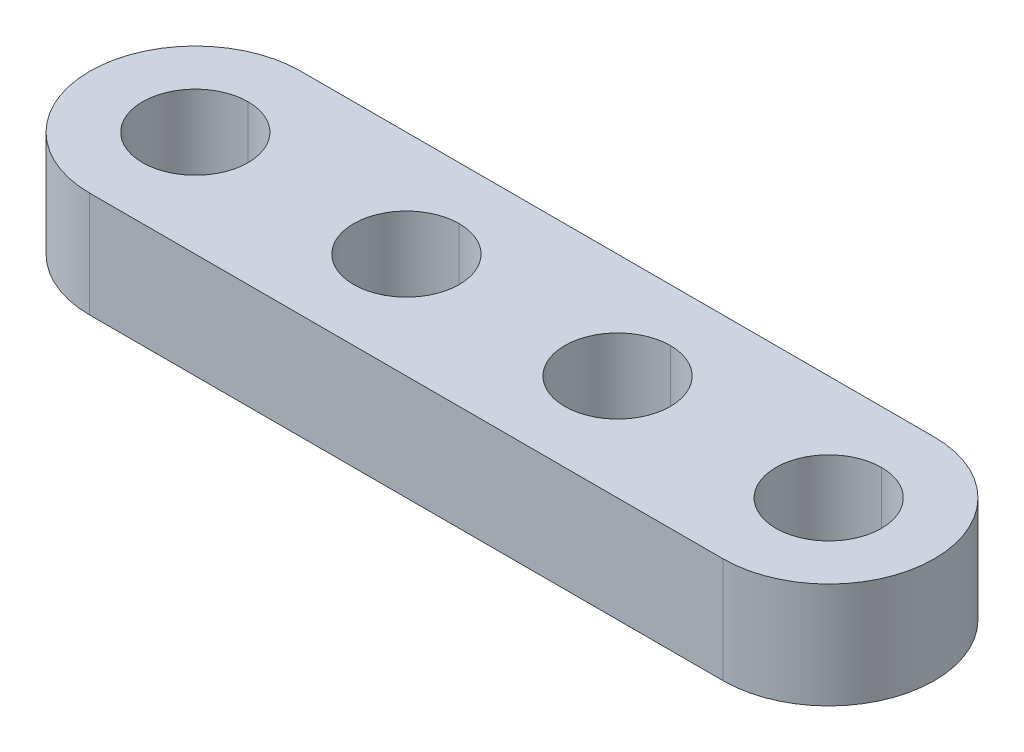
ISO-10303-21;
HEADER;
FILE_DESCRIPTION(('STEP AP214'),'2;1');
FILE_NAME('part.step','',(''),(''),'','','');
FILE_SCHEMA(('AUTOMOTIVE_DESIGN { 1 0 10303 214 1 1 1 1 }'));
ENDSEC;
DATA;
#1=APPLICATION_CONTEXT('core data for automotive mechanical design processes');
#2=APPLICATION_PROTOCOL_DEFINITION('international standard','automotive_design',2000,#1);
#3=PRODUCT_CONTEXT('',#1,'mechanical');
#4=PRODUCT('Part','Part','',(#3));
#5=PRODUCT_RELATED_PRODUCT_CATEGORY('part','',(#4));
#6=PRODUCT_DEFINITION_FORMATION('','',#4);
#7=PRODUCT_DEFINITION_CONTEXT('part definition',#1,'design');
#8=PRODUCT_DEFINITION('design','',#6,#7);
#9=PRODUCT_DEFINITION_SHAPE('','',#8);
#10=(LENGTH_UNIT() NAMED_UNIT(*) SI_UNIT(.MILLI.,.METRE.));
#11=(NAMED_UNIT(*) PLANE_ANGLE_UNIT() SI_UNIT($,.RADIAN.));
#12=(NAMED_UNIT(*) SI_UNIT($,.STERADIAN.) SOLID_ANGLE_UNIT());
#13=UNCERTAINTY_MEASURE_WITH_UNIT(LENGTH_MEASURE(1.E-05),#10,'distance_accuracy_value','');
#14=(GEOMETRIC_REPRESENTATION_CONTEXT(3) GLOBAL_UNCERTAINTY_ASSIGNED_CONTEXT((#13)) GLOBAL_UNIT_ASSIGNED_CONTEXT((#10,
#11,#12)) REPRESENTATION_CONTEXT('',''));
#15=CARTESIAN_POINT('',(0.,0.,0.));
#16=DIRECTION('',(0.,0.,1.));
#17=DIRECTION('',(1.,0.,0.));
#18=AXIS2_PLACEMENT_3D('',#15,#16,#17);
#19=CARTESIAN_POINT('',(12.,4.,0.));
#20=DIRECTION('',(0.,1.,0.));
#21=DIRECTION('',(0.,0.,1.));
#22=AXIS2_PLACEMENT_3D('',#19,#20,#21);
#23=CYLINDRICAL_SURFACE('',#22,2.);
#24=DIRECTION('',(0.,1.,0.));
#25=VECTOR('',#24,1.);
#26=CARTESIAN_POINT('',(12.,4.,-2.));
#27=LINE('',#26,#25);
#28=CARTESIAN_POINT('',(12.,0.,-2.));
#29=VERTEX_POINT('',#28);
#30=CARTESIAN_POINT('',(12.,4.,-2.));
#31=VERTEX_POINT('',#30);
#32=EDGE_CURVE('E137',#29,#31,#27,.T.);
#33=ORIENTED_EDGE('',*,*,#32,.F.);
#34=CARTESIAN_POINT('',(12.,0.,0.));
#35=DIRECTION('',(0.,1.,0.));
#36=DIRECTION('',(0.,0.,1.));
#37=AXIS2_PLACEMENT_3D('',#34,#35,#36);
#38=CIRCLE('',#37,2.);
#39=CARTESIAN_POINT('',(12.,0.,2.));
#40=VERTEX_POINT('',#39);
#41=EDGE_CURVE('E132',#40,#29,#38,.T.);
#42=ORIENTED_EDGE('',*,*,#41,.F.);
#43=DIRECTION('',(0.,1.,0.));
#44=VECTOR('',#43,1.);
#45=CARTESIAN_POINT('',(12.,4.,2.));
#46=LINE('',#45,#44);
#47=CARTESIAN_POINT('',(12.,4.,2.));
#48=VERTEX_POINT('',#47);
#49=EDGE_CURVE('E134',#40,#48,#46,.T.);
#50=ORIENTED_EDGE('',*,*,#49,.T.);
#51=CARTESIAN_POINT('',(12.,4.,0.));
#52=DIRECTION('',(0.,1.,0.));
#53=DIRECTION('',(0.,0.,1.));
#54=AXIS2_PLACEMENT_3D('',#51,#52,#53);
#55=CIRCLE('',#54,2.);
#56=EDGE_CURVE('E172',#48,#31,#55,.T.);
#57=ORIENTED_EDGE('',*,*,#56,.T.);
#58=EDGE_LOOP('',(#33,#42,#50,#57));
#59=FACE_BOUND('',#58,.T.);
#60=ADVANCED_FACE('F15',(#59),#23,.F.);
#61=CARTESIAN_POINT('',(4.,4.,0.));
#62=DIRECTION('',(0.,1.,0.));
#63=DIRECTION('',(0.,0.,1.));
#64=AXIS2_PLACEMENT_3D('',#61,#62,#63);
#65=CYLINDRICAL_SURFACE('',#64,2.);
#66=DIRECTION('',(0.,1.,0.));
#67=VECTOR('',#66,1.);
#68=CARTESIAN_POINT('',(4.,4.,-2.));
#69=LINE('',#68,#67);
#70=CARTESIAN_POINT('',(4.,0.,-2.));
#71=VERTEX_POINT('',#70);
#72=CARTESIAN_POINT('',(4.,4.,-2.));
#73=VERTEX_POINT('',#72);
#74=EDGE_CURVE('E550',#71,#73,#69,.T.);
#75=ORIENTED_EDGE('',*,*,#74,.F.);
#76=CARTESIAN_POINT('',(4.,0.,0.));
#77=DIRECTION('',(0.,1.,0.));
#78=DIRECTION('',(0.,0.,1.));
#79=AXIS2_PLACEMENT_3D('',#76,#77,#78);
#80=CIRCLE('',#79,2.);
#81=CARTESIAN_POINT('',(4.,0.,2.));
#82=VERTEX_POINT('',#81);
#83=EDGE_CURVE('E72',#82,#71,#80,.T.);
#84=ORIENTED_EDGE('',*,*,#83,.F.);
#85=DIRECTION('',(0.,1.,0.));
#86=VECTOR('',#85,1.);
#87=CARTESIAN_POINT('',(4.,4.,2.));
#88=LINE('',#87,#86);
#89=CARTESIAN_POINT('',(4.,4.,2.));
#90=VERTEX_POINT('',#89);
#91=EDGE_CURVE('E189',#82,#90,#88,.T.);
#92=ORIENTED_EDGE('',*,*,#91,.T.);
#93=CARTESIAN_POINT('',(4.,4.,0.));
#94=DIRECTION('',(0.,1.,0.));
#95=DIRECTION('',(0.,0.,1.));
#96=AXIS2_PLACEMENT_3D('',#93,#94,#95);
#97=CIRCLE('',#96,2.);
#98=EDGE_CURVE('E59',#90,#73,#97,.T.);
#99=ORIENTED_EDGE('',*,*,#98,.T.);
#100=EDGE_LOOP('',(#75,#84,#92,#99));
#101=FACE_BOUND('',#100,.T.);
#102=ADVANCED_FACE('F309',(#101),#65,.F.);
#103=CARTESIAN_POINT('',(-4.,4.,0.));
#104=DIRECTION('',(0.,1.,0.));
#105=DIRECTION('',(0.,0.,1.));
#106=AXIS2_PLACEMENT_3D('',#103,#104,#105);
#107=CYLINDRICAL_SURFACE('',#106,2.);
#108=DIRECTION('',(0.,1.,0.));
#109=VECTOR('',#108,1.);
#110=CARTESIAN_POINT('',(-4.,4.,-2.));
#111=LINE('',#110,#109);
#112=CARTESIAN_POINT('',(-4.,0.,-2.));
#113=VERTEX_POINT('',#112);
#114=CARTESIAN_POINT('',(-4.,4.,-2.));
#115=VERTEX_POINT('',#114);
#116=EDGE_CURVE('E197',#113,#115,#111,.T.);
#117=ORIENTED_EDGE('',*,*,#116,.F.);
#118=CARTESIAN_POINT('',(-4.,0.,0.));
#119=DIRECTION('',(0.,1.,0.));
#120=DIRECTION('',(0.,0.,1.));
#121=AXIS2_PLACEMENT_3D('',#118,#119,#120);
#122=CIRCLE('',#121,2.);
#123=CARTESIAN_POINT('',(-4.,0.,2.));
#124=VERTEX_POINT('',#123);
#125=EDGE_CURVE('E25',#124,#113,#122,.T.);
#126=ORIENTED_EDGE('',*,*,#125,.F.);
#127=DIRECTION('',(0.,1.,0.));
#128=VECTOR('',#127,1.);
#129=CARTESIAN_POINT('',(-4.,4.,2.));
#130=LINE('',#129,#128);
#131=CARTESIAN_POINT('',(-4.,4.,2.));
#132=VERTEX_POINT('',#131);
#133=EDGE_CURVE('E233',#124,#132,#130,.T.);
#134=ORIENTED_EDGE('',*,*,#133,.T.);
#135=CARTESIAN_POINT('',(-4.,4.,0.));
#136=DIRECTION('',(0.,1.,0.));
#137=DIRECTION('',(0.,0.,1.));
#138=AXIS2_PLACEMENT_3D('',#135,#136,#137);
#139=CIRCLE('',#138,2.);
#140=EDGE_CURVE('E95',#132,#115,#139,.T.);
#141=ORIENTED_EDGE('',*,*,#140,.T.);
#142=EDGE_LOOP('',(#117,#126,#134,#141));
#143=FACE_BOUND('',#142,.T.);
#144=ADVANCED_FACE('F314',(#143),#107,.F.);
#145=CARTESIAN_POINT('',(-12.,4.,0.));
#146=DIRECTION('',(0.,1.,0.));
#147=DIRECTION('',(0.,0.,1.));
#148=AXIS2_PLACEMENT_3D('',#145,#146,#147);
#149=CYLINDRICAL_SURFACE('',#148,2.);
#150=DIRECTION('',(0.,1.,0.));
#151=VECTOR('',#150,1.);
#152=CARTESIAN_POINT('',(-12.,4.,-2.));
#153=LINE('',#152,#151);
#154=CARTESIAN_POINT('',(-12.,0.,-2.));
#155=VERTEX_POINT('',#154);
#156=CARTESIAN_POINT('',(-12.,4.,-2.));
#157=VERTEX_POINT('',#156);
#158=EDGE_CURVE('E218',#155,#157,#153,.T.);
#159=ORIENTED_EDGE('',*,*,#158,.F.);
#160=CARTESIAN_POINT('',(-12.,0.,0.));
#161=DIRECTION('',(0.,1.,0.));
#162=DIRECTION('',(0.,0.,1.));
#163=AXIS2_PLACEMENT_3D('',#160,#161,#162);
#164=CIRCLE('',#163,2.);
#165=CARTESIAN_POINT('',(-12.,0.,2.));
#166=VERTEX_POINT('',#165);
#167=EDGE_CURVE('E10',#166,#155,#164,.T.);
#168=ORIENTED_EDGE('',*,*,#167,.F.);
#169=DIRECTION('',(0.,1.,0.));
#170=VECTOR('',#169,1.);
#171=CARTESIAN_POINT('',(-12.,4.,2.));
#172=LINE('',#171,#170);
#173=CARTESIAN_POINT('',(-12.,4.,2.));
#174=VERTEX_POINT('',#173);
#175=EDGE_CURVE('E182',#166,#174,#172,.T.);
#176=ORIENTED_EDGE('',*,*,#175,.T.);
#177=CARTESIAN_POINT('',(-12.,4.,0.));
#178=DIRECTION('',(0.,1.,0.));
#179=DIRECTION('',(0.,0.,1.));
#180=AXIS2_PLACEMENT_3D('',#177,#178,#179);
#181=CIRCLE('',#180,2.);
#182=EDGE_CURVE('E142',#174,#157,#181,.T.);
#183=ORIENTED_EDGE('',*,*,#182,.T.);
#184=EDGE_LOOP('',(#159,#168,#176,#183));
#185=FACE_BOUND('',#184,.T.);
#186=ADVANCED_FACE('F318',(#185),#149,.F.);
#187=CARTESIAN_POINT('',(-12.,0.,0.));
#188=DIRECTION('',(0.,1.,0.));
#189=DIRECTION('',(1.,0.,0.));
#190=AXIS2_PLACEMENT_3D('',#187,#188,#189);
#191=PLANE('',#190);
#192=ORIENTED_EDGE('',*,*,#167,.T.);
#193=CARTESIAN_POINT('',(-12.,0.,0.));
#194=DIRECTION('',(0.,1.,0.));
#195=DIRECTION('',(0.,0.,1.));
#196=AXIS2_PLACEMENT_3D('',#193,#194,#195);
#197=CIRCLE('',#196,2.);
#198=EDGE_CURVE('E221',#155,#166,#197,.T.);
#199=ORIENTED_EDGE('',*,*,#198,.T.);
#200=EDGE_LOOP('',(#192,#199));
#201=FACE_BOUND('',#200,.T.);
#202=ORIENTED_EDGE('',*,*,#125,.T.);
#203=CARTESIAN_POINT('',(-4.,0.,0.));
#204=DIRECTION('',(0.,1.,0.));
#205=DIRECTION('',(0.,0.,1.));
#206=AXIS2_PLACEMENT_3D('',#203,#204,#205);
#207=CIRCLE('',#206,2.);
#208=EDGE_CURVE('E192',#113,#124,#207,.T.);
#209=ORIENTED_EDGE('',*,*,#208,.T.);
#210=EDGE_LOOP('',(#202,#209));
#211=FACE_BOUND('',#210,.T.);
#212=ORIENTED_EDGE('',*,*,#83,.T.);
#213=CARTESIAN_POINT('',(4.,0.,0.));
#214=DIRECTION('',(0.,1.,0.));
#215=DIRECTION('',(0.,0.,1.));
#216=AXIS2_PLACEMENT_3D('',#213,#214,#215);
#217=CIRCLE('',#216,2.);
#218=EDGE_CURVE('E150',#71,#82,#217,.T.);
#219=ORIENTED_EDGE('',*,*,#218,.T.);
#220=EDGE_LOOP('',(#212,#219));
#221=FACE_BOUND('',#220,.T.);
#222=ORIENTED_EDGE('',*,*,#41,.T.);
#223=CARTESIAN_POINT('',(12.,0.,0.));
#224=DIRECTION('',(0.,1.,0.));
#225=DIRECTION('',(0.,0.,1.));
#226=AXIS2_PLACEMENT_3D('',#223,#224,#225);
#227=CIRCLE('',#226,2.);
#228=EDGE_CURVE('E146',#29,#40,#227,.T.);
#229=ORIENTED_EDGE('',*,*,#228,.T.);
#230=EDGE_LOOP('',(#222,#229));
#231=FACE_BOUND('',#230,.T.);
#232=CARTESIAN_POINT('',(-12.,0.,0.));
#233=DIRECTION('',(0.,1.,0.));
#234=DIRECTION('',(0.,0.,1.));
#235=AXIS2_PLACEMENT_3D('',#232,#233,#234);
#236=CIRCLE('',#235,4.);
#237=CARTESIAN_POINT('',(-12.,0.,-4.));
#238=VERTEX_POINT('',#237);
#239=CARTESIAN_POINT('',(-12.,0.,4.));
#240=VERTEX_POINT('',#239);
#241=EDGE_CURVE('E170',#238,#240,#236,.T.);
#242=ORIENTED_EDGE('',*,*,#241,.F.);
#243=DIRECTION('',(-1.,0.,0.));
#244=VECTOR('',#243,1.);
#245=CARTESIAN_POINT('',(-12.,0.,-4.));
#246=LINE('',#245,#244);
#247=CARTESIAN_POINT('',(12.,0.,-4.));
#248=VERTEX_POINT('',#247);
#249=EDGE_CURVE('E177',#248,#238,#246,.T.);
#250=ORIENTED_EDGE('',*,*,#249,.F.);
#251=CARTESIAN_POINT('',(12.,0.,0.));
#252=DIRECTION('',(0.,1.,0.));
#253=DIRECTION('',(0.,0.,1.));
#254=AXIS2_PLACEMENT_3D('',#251,#252,#253);
#255=CIRCLE('',#254,4.);
#256=CARTESIAN_POINT('',(12.,0.,4.));
#257=VERTEX_POINT('',#256);
#258=EDGE_CURVE('E164',#257,#248,#255,.T.);
#259=ORIENTED_EDGE('',*,*,#258,.F.);
#260=DIRECTION('',(1.,0.,0.));
#261=VECTOR('',#260,1.);
#262=CARTESIAN_POINT('',(-12.,0.,4.));
#263=LINE('',#262,#261);
#264=EDGE_CURVE('E207',#240,#257,#263,.T.);
#265=ORIENTED_EDGE('',*,*,#264,.F.);
#266=EDGE_LOOP('',(#242,#250,#259,#265));
#267=FACE_BOUND('',#266,.T.);
#268=ADVANCED_FACE('F152',(#201,#211,#221,#231,#267),#191,.F.);
#269=CARTESIAN_POINT('',(-12.,4.,0.));
#270=DIRECTION('',(0.,1.,0.));
#271=DIRECTION('',(1.,0.,0.));
#272=AXIS2_PLACEMENT_3D('',#269,#270,#271);
#273=PLANE('',#272);
#274=ORIENTED_EDGE('',*,*,#182,.F.);
#275=CARTESIAN_POINT('',(-12.,4.,0.));
#276=DIRECTION('',(0.,1.,0.));
#277=DIRECTION('',(0.,0.,1.));
#278=AXIS2_PLACEMENT_3D('',#275,#276,#277);
#279=CIRCLE('',#278,2.);
#280=EDGE_CURVE('E186',#157,#174,#279,.T.);
#281=ORIENTED_EDGE('',*,*,#280,.F.);
#282=EDGE_LOOP('',(#274,#281));
#283=FACE_BOUND('',#282,.T.);
#284=ORIENTED_EDGE('',*,*,#140,.F.);
#285=CARTESIAN_POINT('',(-4.,4.,0.));
#286=DIRECTION('',(0.,1.,0.));
#287=DIRECTION('',(0.,0.,1.));
#288=AXIS2_PLACEMENT_3D('',#285,#286,#287);
#289=CIRCLE('',#288,2.);
#290=EDGE_CURVE('E201',#115,#132,#289,.T.);
#291=ORIENTED_EDGE('',*,*,#290,.F.);
#292=EDGE_LOOP('',(#284,#291));
#293=FACE_BOUND('',#292,.T.);
#294=ORIENTED_EDGE('',*,*,#98,.F.);
#295=CARTESIAN_POINT('',(4.,4.,0.));
#296=DIRECTION('',(0.,1.,0.));
#297=DIRECTION('',(0.,0.,1.));
#298=AXIS2_PLACEMENT_3D('',#295,#296,#297);
#299=CIRCLE('',#298,2.);
#300=EDGE_CURVE('E193',#73,#90,#299,.T.);
#301=ORIENTED_EDGE('',*,*,#300,.F.);
#302=EDGE_LOOP('',(#294,#301));
#303=FACE_BOUND('',#302,.T.);
#304=ORIENTED_EDGE('',*,*,#56,.F.);
#305=CARTESIAN_POINT('',(12.,4.,0.));
#306=DIRECTION('',(0.,1.,0.));
#307=DIRECTION('',(0.,0.,1.));
#308=AXIS2_PLACEMENT_3D('',#305,#306,#307);
#309=CIRCLE('',#308,2.);
#310=EDGE_CURVE('E148',#31,#48,#309,.T.);
#311=ORIENTED_EDGE('',*,*,#310,.F.);
#312=EDGE_LOOP('',(#304,#311));
#313=FACE_BOUND('',#312,.T.);
#314=CARTESIAN_POINT('',(-12.,4.,0.));
#315=DIRECTION('',(0.,1.,0.));
#316=DIRECTION('',(0.,0.,1.));
#317=AXIS2_PLACEMENT_3D('',#314,#315,#316);
#318=CIRCLE('',#317,4.);
#319=CARTESIAN_POINT('',(-12.,4.,-4.));
#320=VERTEX_POINT('',#319);
#321=CARTESIAN_POINT('',(-12.,4.,4.));
#322=VERTEX_POINT('',#321);
#323=EDGE_CURVE('E169',#320,#322,#318,.T.);
#324=ORIENTED_EDGE('',*,*,#323,.T.);
#325=DIRECTION('',(1.,0.,0.));
#326=VECTOR('',#325,1.);
#327=CARTESIAN_POINT('',(-12.,4.,4.));
#328=LINE('',#327,#326);
#329=CARTESIAN_POINT('',(12.,4.,4.));
#330=VERTEX_POINT('',#329);
#331=EDGE_CURVE('E206',#322,#330,#328,.T.);
#332=ORIENTED_EDGE('',*,*,#331,.T.);
#333=CARTESIAN_POINT('',(12.,4.,0.));
#334=DIRECTION('',(0.,1.,0.));
#335=DIRECTION('',(0.,0.,1.));
#336=AXIS2_PLACEMENT_3D('',#333,#334,#335);
#337=CIRCLE('',#336,4.);
#338=CARTESIAN_POINT('',(12.,4.,-4.));
#339=VERTEX_POINT('',#338);
#340=EDGE_CURVE('E174',#330,#339,#337,.T.);
#341=ORIENTED_EDGE('',*,*,#340,.T.);
#342=DIRECTION('',(-1.,0.,0.));
#343=VECTOR('',#342,1.);
#344=CARTESIAN_POINT('',(-12.,4.,-4.));
#345=LINE('',#344,#343);
#346=EDGE_CURVE('E39',#339,#320,#345,.T.);
#347=ORIENTED_EDGE('',*,*,#346,.T.);
#348=EDGE_LOOP('',(#324,#332,#341,#347));
#349=FACE_BOUND('',#348,.T.);
#350=ADVANCED_FACE('F289',(#283,#293,#303,#313,#349),#273,.T.);
#351=CARTESIAN_POINT('',(-12.,4.,-4.));
#352=DIRECTION('',(0.,0.,1.));
#353=DIRECTION('',(1.,0.,0.));
#354=AXIS2_PLACEMENT_3D('',#351,#352,#353);
#355=PLANE('',#354);
#356=ORIENTED_EDGE('',*,*,#249,.T.);
#357=DIRECTION('',(0.,-1.,0.));
#358=VECTOR('',#357,1.);
#359=CARTESIAN_POINT('',(-12.,4.,-4.));
#360=LINE('',#359,#358);
#361=EDGE_CURVE('E210',#320,#238,#360,.T.);
#362=ORIENTED_EDGE('',*,*,#361,.F.);
#363=ORIENTED_EDGE('',*,*,#346,.F.);
#364=DIRECTION('',(0.,-1.,0.));
#365=VECTOR('',#364,1.);
#366=CARTESIAN_POINT('',(12.,4.,-4.));
#367=LINE('',#366,#365);
#368=EDGE_CURVE('E178',#339,#248,#367,.T.);
#369=ORIENTED_EDGE('',*,*,#368,.T.);
#370=EDGE_LOOP('',(#356,#362,#363,#369));
#371=FACE_BOUND('',#370,.T.);
#372=ADVANCED_FACE('F292',(#371),#355,.F.);
#373=CARTESIAN_POINT('',(12.,4.,0.));
#374=DIRECTION('',(0.,-1.,0.));
#375=DIRECTION('',(0.,0.,-1.));
#376=AXIS2_PLACEMENT_3D('',#373,#374,#375);
#377=CYLINDRICAL_SURFACE('',#376,4.);
#378=ORIENTED_EDGE('',*,*,#258,.T.);
#379=ORIENTED_EDGE('',*,*,#368,.F.);
#380=ORIENTED_EDGE('',*,*,#340,.F.);
#381=DIRECTION('',(0.,-1.,0.));
#382=VECTOR('',#381,1.);
#383=CARTESIAN_POINT('',(12.,4.,4.));
#384=LINE('',#383,#382);
#385=EDGE_CURVE('E202',#330,#257,#384,.T.);
#386=ORIENTED_EDGE('',*,*,#385,.T.);
#387=EDGE_LOOP('',(#378,#379,#380,#386));
#388=FACE_BOUND('',#387,.T.);
#389=ADVANCED_FACE('F299',(#388),#377,.T.);
#390=CARTESIAN_POINT('',(-12.,4.,4.));
#391=DIRECTION('',(0.,0.,-1.));
#392=DIRECTION('',(0.,-1.,0.));
#393=AXIS2_PLACEMENT_3D('',#390,#391,#392);
#394=PLANE('',#393);
#395=ORIENTED_EDGE('',*,*,#264,.T.);
#396=ORIENTED_EDGE('',*,*,#385,.F.);
#397=ORIENTED_EDGE('',*,*,#331,.F.);
#398=DIRECTION('',(0.,-1.,0.));
#399=VECTOR('',#398,1.);
#400=CARTESIAN_POINT('',(-12.,4.,4.));
#401=LINE('',#400,#399);
#402=EDGE_CURVE('E166',#322,#240,#401,.T.);
#403=ORIENTED_EDGE('',*,*,#402,.T.);
#404=EDGE_LOOP('',(#395,#396,#397,#403));
#405=FACE_BOUND('',#404,.T.);
#406=ADVANCED_FACE('F17',(#405),#394,.F.);
#407=CARTESIAN_POINT('',(-12.,4.,0.));
#408=DIRECTION('',(0.,-1.,0.));
#409=DIRECTION('',(0.,0.,-1.));
#410=AXIS2_PLACEMENT_3D('',#407,#408,#409);
#411=CYLINDRICAL_SURFACE('',#410,4.);
#412=ORIENTED_EDGE('',*,*,#241,.T.);
#413=ORIENTED_EDGE('',*,*,#402,.F.);
#414=ORIENTED_EDGE('',*,*,#323,.F.);
#415=ORIENTED_EDGE('',*,*,#361,.T.);
#416=EDGE_LOOP('',(#412,#413,#414,#415));
#417=FACE_BOUND('',#416,.T.);
#418=ADVANCED_FACE('F297',(#417),#411,.T.);
#419=CARTESIAN_POINT('',(-12.,4.,0.));
#420=DIRECTION('',(0.,1.,0.));
#421=DIRECTION('',(0.,0.,1.));
#422=AXIS2_PLACEMENT_3D('',#419,#420,#421);
#423=CYLINDRICAL_SURFACE('',#422,2.);
#424=ORIENTED_EDGE('',*,*,#198,.F.);
#425=ORIENTED_EDGE('',*,*,#158,.T.);
#426=ORIENTED_EDGE('',*,*,#280,.T.);
#427=ORIENTED_EDGE('',*,*,#175,.F.);
#428=EDGE_LOOP('',(#424,#425,#426,#427));
#429=FACE_BOUND('',#428,.T.);
#430=ADVANCED_FACE('F323',(#429),#423,.F.);
#431=CARTESIAN_POINT('',(-4.,4.,0.));
#432=DIRECTION('',(0.,1.,0.));
#433=DIRECTION('',(0.,0.,1.));
#434=AXIS2_PLACEMENT_3D('',#431,#432,#433);
#435=CYLINDRICAL_SURFACE('',#434,2.);
#436=ORIENTED_EDGE('',*,*,#208,.F.);
#437=ORIENTED_EDGE('',*,*,#116,.T.);
#438=ORIENTED_EDGE('',*,*,#290,.T.);
#439=ORIENTED_EDGE('',*,*,#133,.F.);
#440=EDGE_LOOP('',(#436,#437,#438,#439));
#441=FACE_BOUND('',#440,.T.);
#442=ADVANCED_FACE('F324',(#441),#435,.F.);
#443=CARTESIAN_POINT('',(4.,4.,0.));
#444=DIRECTION('',(0.,1.,0.));
#445=DIRECTION('',(0.,0.,1.));
#446=AXIS2_PLACEMENT_3D('',#443,#444,#445);
#447=CYLINDRICAL_SURFACE('',#446,2.);
#448=ORIENTED_EDGE('',*,*,#218,.F.);
#449=ORIENTED_EDGE('',*,*,#74,.T.);
#450=ORIENTED_EDGE('',*,*,#300,.T.);
#451=ORIENTED_EDGE('',*,*,#91,.F.);
#452=EDGE_LOOP('',(#448,#449,#450,#451));
#453=FACE_BOUND('',#452,.T.);
#454=ADVANCED_FACE('F326',(#453),#447,.F.);
#455=CARTESIAN_POINT('',(12.,4.,0.));
#456=DIRECTION('',(0.,1.,0.));
#457=DIRECTION('',(0.,0.,1.));
#458=AXIS2_PLACEMENT_3D('',#455,#456,#457);
#459=CYLINDRICAL_SURFACE('',#458,2.);
#460=ORIENTED_EDGE('',*,*,#228,.F.);
#461=ORIENTED_EDGE('',*,*,#32,.T.);
#462=ORIENTED_EDGE('',*,*,#310,.T.);
#463=ORIENTED_EDGE('',*,*,#49,.F.);
#464=EDGE_LOOP('',(#460,#461,#462,#463));
#465=FACE_BOUND('',#464,.T.);
#466=ADVANCED_FACE('F145',(#465),#459,.F.);
#467=CLOSED_SHELL('',(#60,#102,#144,#186,#268,#350,#372,#389,#406,#418,#430,#442,#454,#466));
#468=MANIFOLD_SOLID_BREP('B1',#467);
#469=ADVANCED_BREP_SHAPE_REPRESENTATION('',(#18,#468),#14);
#470=SHAPE_DEFINITION_REPRESENTATION(#9,#469);
ENDSEC;
END-ISO-10303-21;
